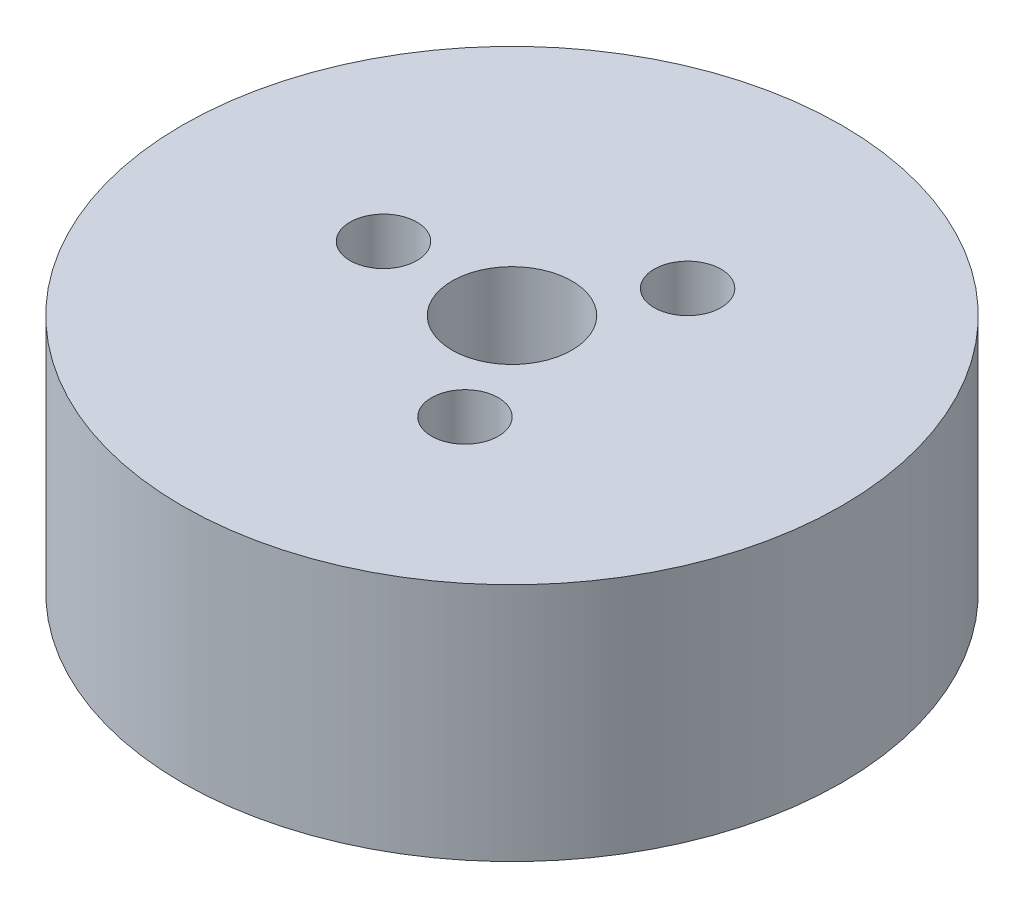
ISO-10303-21;
HEADER;
FILE_DESCRIPTION(('STEP AP214'),'2;1');
FILE_NAME('part.step','',(''),(''),'','','');
FILE_SCHEMA(('AUTOMOTIVE_DESIGN { 1 0 10303 214 1 1 1 1 }'));
ENDSEC;
DATA;
#1=APPLICATION_CONTEXT('core data for automotive mechanical design processes');
#2=APPLICATION_PROTOCOL_DEFINITION('international standard','automotive_design',2000,#1);
#3=PRODUCT_CONTEXT('',#1,'mechanical');
#4=PRODUCT('Part','Part','',(#3));
#5=PRODUCT_RELATED_PRODUCT_CATEGORY('part','',(#4));
#6=PRODUCT_DEFINITION_FORMATION('','',#4);
#7=PRODUCT_DEFINITION_CONTEXT('part definition',#1,'design');
#8=PRODUCT_DEFINITION('design','',#6,#7);
#9=PRODUCT_DEFINITION_SHAPE('','',#8);
#10=(LENGTH_UNIT() NAMED_UNIT(*) SI_UNIT(.MILLI.,.METRE.));
#11=(NAMED_UNIT(*) PLANE_ANGLE_UNIT() SI_UNIT($,.RADIAN.));
#12=(NAMED_UNIT(*) SI_UNIT($,.STERADIAN.) SOLID_ANGLE_UNIT());
#13=UNCERTAINTY_MEASURE_WITH_UNIT(LENGTH_MEASURE(1.E-05),#10,'distance_accuracy_value','');
#14=(GEOMETRIC_REPRESENTATION_CONTEXT(3) GLOBAL_UNCERTAINTY_ASSIGNED_CONTEXT((#13)) GLOBAL_UNIT_ASSIGNED_CONTEXT((#10,
#11,#12)) REPRESENTATION_CONTEXT('',''));
#15=CARTESIAN_POINT('',(0.,0.,0.));
#16=DIRECTION('',(0.,0.,1.));
#17=DIRECTION('',(1.,0.,0.));
#18=AXIS2_PLACEMENT_3D('',#15,#16,#17);
#19=CARTESIAN_POINT('',(0.,20.,0.));
#20=DIRECTION('',(0.,-1.,0.));
#21=DIRECTION('',(0.,0.,-1.));
#22=AXIS2_PLACEMENT_3D('',#19,#20,#21);
#23=CYLINDRICAL_SURFACE('',#22,27.5);
#24=CARTESIAN_POINT('',(0.,20.,0.));
#25=DIRECTION('',(0.,1.,0.));
#26=DIRECTION('',(0.,0.,1.));
#27=AXIS2_PLACEMENT_3D('',#24,#25,#26);
#28=CIRCLE('',#27,27.5);
#29=CARTESIAN_POINT('',(0.,20.,27.5));
#30=VERTEX_POINT('',#29);
#31=EDGE_CURVE('E10',#30,#30,#28,.T.);
#32=ORIENTED_EDGE('',*,*,#31,.F.);
#33=EDGE_LOOP('',(#32));
#34=FACE_BOUND('',#33,.T.);
#35=CARTESIAN_POINT('',(0.,0.,0.));
#36=DIRECTION('',(0.,1.,0.));
#37=DIRECTION('',(0.,0.,1.));
#38=AXIS2_PLACEMENT_3D('',#35,#36,#37);
#39=CIRCLE('',#38,27.5);
#40=CARTESIAN_POINT('',(0.,0.,27.5));
#41=VERTEX_POINT('',#40);
#42=EDGE_CURVE('E37',#41,#41,#39,.T.);
#43=ORIENTED_EDGE('',*,*,#42,.T.);
#44=EDGE_LOOP('',(#43));
#45=FACE_BOUND('',#44,.T.);
#46=ADVANCED_FACE('F40',(#34,#45),#23,.T.);
#47=CARTESIAN_POINT('',(0.,20.,0.));
#48=DIRECTION('',(0.,1.,0.));
#49=DIRECTION('',(0.,0.,1.));
#50=AXIS2_PLACEMENT_3D('',#47,#48,#49);
#51=PLANE('',#50);
#52=CARTESIAN_POINT('',(5.36059343283373,20.,9.28482018438799));
#53=DIRECTION('',(0.,1.,0.));
#54=DIRECTION('',(0.866025403784436,0.,-0.500000000000004));
#55=AXIS2_PLACEMENT_3D('',#52,#53,#54);
#56=CIRCLE('',#55,2.78757138879246);
#57=CARTESIAN_POINT('',(7.77470107039066,20.,7.89103448999175));
#58=VERTEX_POINT('',#57);
#59=EDGE_CURVE('E70',#58,#58,#56,.T.);
#60=ORIENTED_EDGE('',*,*,#59,.F.);
#61=EDGE_LOOP('',(#60));
#62=FACE_BOUND('',#61,.T.);
#63=CARTESIAN_POINT('',(5.3605934328336,20.,-9.28482018438806));
#64=DIRECTION('',(0.,1.,0.));
#65=DIRECTION('',(-0.866025403784443,0.,-0.499999999999992));
#66=AXIS2_PLACEMENT_3D('',#63,#64,#65);
#67=CIRCLE('',#66,2.78757138879246);
#68=CARTESIAN_POINT('',(2.94648579527665,20.,-10.6786058787843));
#69=VERTEX_POINT('',#68);
#70=EDGE_CURVE('E61',#69,#69,#67,.T.);
#71=ORIENTED_EDGE('',*,*,#70,.F.);
#72=EDGE_LOOP('',(#71));
#73=FACE_BOUND('',#72,.T.);
#74=CARTESIAN_POINT('',(-10.7211868656674,20.,0.));
#75=DIRECTION('',(0.,1.,0.));
#76=DIRECTION('',(0.,0.,1.));
#77=AXIS2_PLACEMENT_3D('',#74,#75,#76);
#78=CIRCLE('',#77,2.78757138879246);
#79=CARTESIAN_POINT('',(-10.7211868656674,20.,2.78757138879246));
#80=VERTEX_POINT('',#79);
#81=EDGE_CURVE('E54',#80,#80,#78,.T.);
#82=ORIENTED_EDGE('',*,*,#81,.F.);
#83=EDGE_LOOP('',(#82));
#84=FACE_BOUND('',#83,.T.);
#85=CARTESIAN_POINT('',(0.,20.,0.));
#86=DIRECTION('',(0.,1.,0.));
#87=DIRECTION('',(0.,0.,1.));
#88=AXIS2_PLACEMENT_3D('',#85,#86,#87);
#89=CIRCLE('',#88,5.);
#90=CARTESIAN_POINT('',(0.,20.,5.));
#91=VERTEX_POINT('',#90);
#92=EDGE_CURVE('E50',#91,#91,#89,.T.);
#93=ORIENTED_EDGE('',*,*,#92,.F.);
#94=EDGE_LOOP('',(#93));
#95=FACE_BOUND('',#94,.T.);
#96=ORIENTED_EDGE('',*,*,#31,.T.);
#97=EDGE_LOOP('',(#96));
#98=FACE_BOUND('',#97,.T.);
#99=ADVANCED_FACE('F85',(#62,#73,#84,#95,#98),#51,.T.);
#100=CARTESIAN_POINT('',(0.,0.,0.));
#101=DIRECTION('',(0.,1.,0.));
#102=DIRECTION('',(0.,0.,1.));
#103=AXIS2_PLACEMENT_3D('',#100,#101,#102);
#104=PLANE('',#103);
#105=CARTESIAN_POINT('',(0.,0.,0.));
#106=DIRECTION('',(0.,1.,0.));
#107=DIRECTION('',(0.,0.,1.));
#108=AXIS2_PLACEMENT_3D('',#105,#106,#107);
#109=CIRCLE('',#108,5.);
#110=CARTESIAN_POINT('',(0.,0.,5.));
#111=VERTEX_POINT('',#110);
#112=EDGE_CURVE('E47',#111,#111,#109,.T.);
#113=ORIENTED_EDGE('',*,*,#112,.T.);
#114=EDGE_LOOP('',(#113));
#115=FACE_BOUND('',#114,.T.);
#116=ORIENTED_EDGE('',*,*,#42,.F.);
#117=EDGE_LOOP('',(#116));
#118=FACE_BOUND('',#117,.T.);
#119=ADVANCED_FACE('F84',(#115,#118),#104,.F.);
#120=CARTESIAN_POINT('',(0.,20.,0.));
#121=DIRECTION('',(0.,-1.,0.));
#122=DIRECTION('',(0.,0.,-1.));
#123=AXIS2_PLACEMENT_3D('',#120,#121,#122);
#124=CYLINDRICAL_SURFACE('',#123,5.);
#125=ORIENTED_EDGE('',*,*,#92,.T.);
#126=EDGE_LOOP('',(#125));
#127=FACE_BOUND('',#126,.T.);
#128=ORIENTED_EDGE('',*,*,#112,.F.);
#129=EDGE_LOOP('',(#128));
#130=FACE_BOUND('',#129,.T.);
#131=ADVANCED_FACE('F91',(#127,#130),#124,.F.);
#132=CARTESIAN_POINT('',(-10.7211868656674,3.08037874605304,0.));
#133=DIRECTION('',(0.,1.,0.));
#134=DIRECTION('',(0.,0.,1.));
#135=AXIS2_PLACEMENT_3D('',#132,#133,#134);
#136=CYLINDRICAL_SURFACE('',#135,2.78757138879246);
#137=CARTESIAN_POINT('',(-10.7211868656674,3.08037874605304,0.));
#138=DIRECTION('',(0.,1.,0.));
#139=DIRECTION('',(0.,0.,1.));
#140=AXIS2_PLACEMENT_3D('',#137,#138,#139);
#141=CIRCLE('',#140,2.78757138879246);
#142=CARTESIAN_POINT('',(-10.7211868656674,3.08037874605304,2.78757138879246));
#143=VERTEX_POINT('',#142);
#144=EDGE_CURVE('E55',#143,#143,#141,.T.);
#145=ORIENTED_EDGE('',*,*,#144,.F.);
#146=EDGE_LOOP('',(#145));
#147=FACE_BOUND('',#146,.T.);
#148=ORIENTED_EDGE('',*,*,#81,.T.);
#149=EDGE_LOOP('',(#148));
#150=FACE_BOUND('',#149,.T.);
#151=ADVANCED_FACE('F96',(#147,#150),#136,.F.);
#152=CARTESIAN_POINT('',(-10.7211868656674,3.08037874605304,0.));
#153=DIRECTION('',(0.,1.,0.));
#154=DIRECTION('',(0.,0.,1.));
#155=AXIS2_PLACEMENT_3D('',#152,#153,#154);
#156=PLANE('',#155);
#157=ORIENTED_EDGE('',*,*,#144,.T.);
#158=EDGE_LOOP('',(#157));
#159=FACE_BOUND('',#158,.T.);
#160=ADVANCED_FACE('F127',(#159),#156,.T.);
#161=CARTESIAN_POINT('',(5.3605934328336,3.08037874605304,-9.28482018438806));
#162=DIRECTION('',(0.,1.,0.));
#163=DIRECTION('',(0.,0.,1.));
#164=AXIS2_PLACEMENT_3D('',#161,#162,#163);
#165=CYLINDRICAL_SURFACE('',#164,2.78757138879246);
#166=CARTESIAN_POINT('',(5.3605934328336,3.08037874605304,-9.28482018438806));
#167=DIRECTION('',(0.,1.,0.));
#168=DIRECTION('',(-0.866025403784443,0.,-0.499999999999992));
#169=AXIS2_PLACEMENT_3D('',#166,#167,#168);
#170=CIRCLE('',#169,2.78757138879246);
#171=CARTESIAN_POINT('',(2.94648579527665,3.08037874605304,-10.6786058787843));
#172=VERTEX_POINT('',#171);
#173=EDGE_CURVE('E63',#172,#172,#170,.T.);
#174=ORIENTED_EDGE('',*,*,#173,.F.);
#175=EDGE_LOOP('',(#174));
#176=FACE_BOUND('',#175,.T.);
#177=ORIENTED_EDGE('',*,*,#70,.T.);
#178=EDGE_LOOP('',(#177));
#179=FACE_BOUND('',#178,.T.);
#180=ADVANCED_FACE('F133',(#176,#179),#165,.F.);
#181=CARTESIAN_POINT('',(5.3605934328336,3.08037874605304,-9.28482018438806));
#182=DIRECTION('',(0.,1.,0.));
#183=DIRECTION('',(-0.866025403784443,0.,-0.499999999999992));
#184=AXIS2_PLACEMENT_3D('',#181,#182,#183);
#185=PLANE('',#184);
#186=ORIENTED_EDGE('',*,*,#173,.T.);
#187=EDGE_LOOP('',(#186));
#188=FACE_BOUND('',#187,.T.);
#189=ADVANCED_FACE('F77',(#188),#185,.T.);
#190=CARTESIAN_POINT('',(5.36059343283373,3.08037874605304,9.28482018438799));
#191=DIRECTION('',(0.,1.,0.));
#192=DIRECTION('',(0.,0.,1.));
#193=AXIS2_PLACEMENT_3D('',#190,#191,#192);
#194=CYLINDRICAL_SURFACE('',#193,2.78757138879246);
#195=CARTESIAN_POINT('',(5.36059343283373,3.08037874605304,9.28482018438799));
#196=DIRECTION('',(0.,1.,0.));
#197=DIRECTION('',(0.866025403784436,0.,-0.500000000000004));
#198=AXIS2_PLACEMENT_3D('',#195,#196,#197);
#199=CIRCLE('',#198,2.78757138879246);
#200=CARTESIAN_POINT('',(7.77470107039066,3.08037874605304,7.89103448999175));
#201=VERTEX_POINT('',#200);
#202=EDGE_CURVE('E59',#201,#201,#199,.T.);
#203=ORIENTED_EDGE('',*,*,#202,.F.);
#204=EDGE_LOOP('',(#203));
#205=FACE_BOUND('',#204,.T.);
#206=ORIENTED_EDGE('',*,*,#59,.T.);
#207=EDGE_LOOP('',(#206));
#208=FACE_BOUND('',#207,.T.);
#209=ADVANCED_FACE('F73',(#205,#208),#194,.F.);
#210=CARTESIAN_POINT('',(5.36059343283373,3.08037874605304,9.28482018438799));
#211=DIRECTION('',(0.,1.,0.));
#212=DIRECTION('',(0.866025403784436,0.,-0.500000000000004));
#213=AXIS2_PLACEMENT_3D('',#210,#211,#212);
#214=PLANE('',#213);
#215=ORIENTED_EDGE('',*,*,#202,.T.);
#216=EDGE_LOOP('',(#215));
#217=FACE_BOUND('',#216,.T.);
#218=ADVANCED_FACE('F71',(#217),#214,.T.);
#219=CLOSED_SHELL('',(#46,#99,#119,#131,#151,#160,#180,#189,#209,#218));
#220=MANIFOLD_SOLID_BREP('B2',#219);
#221=ADVANCED_BREP_SHAPE_REPRESENTATION('',(#18,#220),#14);
#222=SHAPE_DEFINITION_REPRESENTATION(#9,#221);
ENDSEC;
END-ISO-10303-21;
